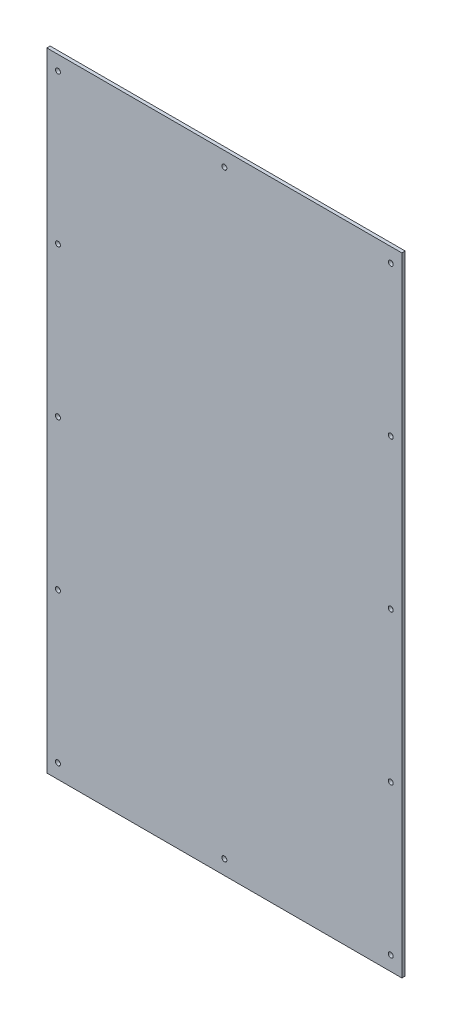
ISO-10303-21;
HEADER;
FILE_DESCRIPTION(('STEP AP214'),'2;1');
FILE_NAME('part.step','',(''),(''),'','','');
FILE_SCHEMA(('AUTOMOTIVE_DESIGN { 1 0 10303 214 1 1 1 1 }'));
ENDSEC;
DATA;
#1=APPLICATION_CONTEXT('core data for automotive mechanical design processes');
#2=APPLICATION_PROTOCOL_DEFINITION('international standard','automotive_design',2000,#1);
#3=PRODUCT_CONTEXT('',#1,'mechanical');
#4=PRODUCT('Part','Part','',(#3));
#5=PRODUCT_RELATED_PRODUCT_CATEGORY('part','',(#4));
#6=PRODUCT_DEFINITION_FORMATION('','',#4);
#7=PRODUCT_DEFINITION_CONTEXT('part definition',#1,'design');
#8=PRODUCT_DEFINITION('design','',#6,#7);
#9=PRODUCT_DEFINITION_SHAPE('','',#8);
#10=(LENGTH_UNIT() NAMED_UNIT(*) SI_UNIT(.MILLI.,.METRE.));
#11=(NAMED_UNIT(*) PLANE_ANGLE_UNIT() SI_UNIT($,.RADIAN.));
#12=(NAMED_UNIT(*) SI_UNIT($,.STERADIAN.) SOLID_ANGLE_UNIT());
#13=UNCERTAINTY_MEASURE_WITH_UNIT(LENGTH_MEASURE(1.E-05),#10,'distance_accuracy_value','');
#14=(GEOMETRIC_REPRESENTATION_CONTEXT(3) GLOBAL_UNCERTAINTY_ASSIGNED_CONTEXT((#13)) GLOBAL_UNIT_ASSIGNED_CONTEXT((#10,
#11,#12)) REPRESENTATION_CONTEXT('',''));
#15=CARTESIAN_POINT('',(0.,0.,0.));
#16=DIRECTION('',(0.,0.,1.));
#17=DIRECTION('',(1.,0.,0.));
#18=AXIS2_PLACEMENT_3D('',#15,#16,#17);
#19=CARTESIAN_POINT('',(0.,0.,3.));
#20=DIRECTION('',(0.,0.,-1.));
#21=DIRECTION('',(-1.,0.,0.));
#22=AXIS2_PLACEMENT_3D('',#19,#20,#21);
#23=PLANE('',#22);
#24=DIRECTION('',(0.,-1.,0.));
#25=VECTOR('',#24,1.);
#26=CARTESIAN_POINT('',(0.,0.,3.));
#27=LINE('',#26,#25);
#28=CARTESIAN_POINT('',(0.,566.,3.));
#29=VERTEX_POINT('',#28);
#30=CARTESIAN_POINT('',(0.,0.,3.));
#31=VERTEX_POINT('',#30);
#32=EDGE_CURVE('E89',#29,#31,#27,.T.);
#33=ORIENTED_EDGE('',*,*,#32,.T.);
#34=DIRECTION('',(1.,0.,0.));
#35=VECTOR('',#34,1.);
#36=CARTESIAN_POINT('',(0.,0.,3.));
#37=LINE('',#36,#35);
#38=CARTESIAN_POINT('',(320.,0.,3.));
#39=VERTEX_POINT('',#38);
#40=EDGE_CURVE('E84',#31,#39,#37,.T.);
#41=ORIENTED_EDGE('',*,*,#40,.T.);
#42=DIRECTION('',(0.,1.,0.));
#43=VECTOR('',#42,1.);
#44=CARTESIAN_POINT('',(320.,0.,3.));
#45=LINE('',#44,#43);
#46=CARTESIAN_POINT('',(320.,566.,3.));
#47=VERTEX_POINT('',#46);
#48=EDGE_CURVE('E87',#39,#47,#45,.T.);
#49=ORIENTED_EDGE('',*,*,#48,.T.);
#50=DIRECTION('',(-1.,0.,0.));
#51=VECTOR('',#50,1.);
#52=CARTESIAN_POINT('',(0.,566.,3.));
#53=LINE('',#52,#51);
#54=EDGE_CURVE('E54',#47,#29,#53,.T.);
#55=ORIENTED_EDGE('',*,*,#54,.T.);
#56=EDGE_LOOP('',(#33,#41,#49,#55));
#57=FACE_BOUND('',#56,.T.);
#58=CARTESIAN_POINT('',(9.9999999999998,553.,3.));
#59=DIRECTION('',(0.,0.,1.));
#60=DIRECTION('',(1.,0.,0.));
#61=AXIS2_PLACEMENT_3D('',#58,#59,#60);
#62=CIRCLE('',#61,2.24999999999997);
#63=CARTESIAN_POINT('',(12.2499999999998,553.,3.));
#64=VERTEX_POINT('',#63);
#65=EDGE_CURVE('E104',#64,#64,#62,.T.);
#66=ORIENTED_EDGE('',*,*,#65,.F.);
#67=EDGE_LOOP('',(#66));
#68=FACE_BOUND('',#67,.T.);
#69=CARTESIAN_POINT('',(9.9999999999998,418.,3.));
#70=DIRECTION('',(0.,0.,1.));
#71=DIRECTION('',(1.,0.,0.));
#72=AXIS2_PLACEMENT_3D('',#69,#70,#71);
#73=CIRCLE('',#72,2.24999999999999);
#74=CARTESIAN_POINT('',(12.2499999999998,418.,3.));
#75=VERTEX_POINT('',#74);
#76=EDGE_CURVE('E119',#75,#75,#73,.T.);
#77=ORIENTED_EDGE('',*,*,#76,.F.);
#78=EDGE_LOOP('',(#77));
#79=FACE_BOUND('',#78,.T.);
#80=CARTESIAN_POINT('',(9.99999999999978,283.,3.));
#81=DIRECTION('',(0.,0.,1.));
#82=DIRECTION('',(1.,0.,0.));
#83=AXIS2_PLACEMENT_3D('',#80,#81,#82);
#84=CIRCLE('',#83,2.24999999999999);
#85=CARTESIAN_POINT('',(12.2499999999998,283.,3.));
#86=VERTEX_POINT('',#85);
#87=EDGE_CURVE('E125',#86,#86,#84,.T.);
#88=ORIENTED_EDGE('',*,*,#87,.F.);
#89=EDGE_LOOP('',(#88));
#90=FACE_BOUND('',#89,.T.);
#91=CARTESIAN_POINT('',(9.99999999999976,148.,3.));
#92=DIRECTION('',(0.,0.,1.));
#93=DIRECTION('',(1.,0.,0.));
#94=AXIS2_PLACEMENT_3D('',#91,#92,#93);
#95=CIRCLE('',#94,2.24999999999999);
#96=CARTESIAN_POINT('',(12.2499999999997,148.,3.));
#97=VERTEX_POINT('',#96);
#98=EDGE_CURVE('E131',#97,#97,#95,.T.);
#99=ORIENTED_EDGE('',*,*,#98,.F.);
#100=EDGE_LOOP('',(#99));
#101=FACE_BOUND('',#100,.T.);
#102=CARTESIAN_POINT('',(9.99999999999974,12.9999999999999,3.));
#103=DIRECTION('',(0.,0.,1.));
#104=DIRECTION('',(1.,0.,0.));
#105=AXIS2_PLACEMENT_3D('',#102,#103,#104);
#106=CIRCLE('',#105,2.24999999999999);
#107=CARTESIAN_POINT('',(12.2499999999997,12.9999999999999,3.));
#108=VERTEX_POINT('',#107);
#109=EDGE_CURVE('E137',#108,#108,#106,.T.);
#110=ORIENTED_EDGE('',*,*,#109,.F.);
#111=EDGE_LOOP('',(#110));
#112=FACE_BOUND('',#111,.T.);
#113=CARTESIAN_POINT('',(160.,553.,3.));
#114=DIRECTION('',(0.,0.,1.));
#115=DIRECTION('',(1.,0.,0.));
#116=AXIS2_PLACEMENT_3D('',#113,#114,#115);
#117=CIRCLE('',#116,2.24999999999999);
#118=CARTESIAN_POINT('',(162.25,553.,3.));
#119=VERTEX_POINT('',#118);
#120=EDGE_CURVE('E143',#119,#119,#117,.T.);
#121=ORIENTED_EDGE('',*,*,#120,.F.);
#122=EDGE_LOOP('',(#121));
#123=FACE_BOUND('',#122,.T.);
#124=CARTESIAN_POINT('',(160.,13.,3.));
#125=DIRECTION('',(0.,0.,1.));
#126=DIRECTION('',(1.,0.,0.));
#127=AXIS2_PLACEMENT_3D('',#124,#125,#126);
#128=CIRCLE('',#127,2.25000000000001);
#129=CARTESIAN_POINT('',(162.25,13.,3.));
#130=VERTEX_POINT('',#129);
#131=EDGE_CURVE('E149',#130,#130,#128,.T.);
#132=ORIENTED_EDGE('',*,*,#131,.F.);
#133=EDGE_LOOP('',(#132));
#134=FACE_BOUND('',#133,.T.);
#135=CARTESIAN_POINT('',(310.,553.,3.));
#136=DIRECTION('',(0.,0.,1.));
#137=DIRECTION('',(1.,0.,0.));
#138=AXIS2_PLACEMENT_3D('',#135,#136,#137);
#139=CIRCLE('',#138,2.24999999999983);
#140=CARTESIAN_POINT('',(312.25,553.,3.));
#141=VERTEX_POINT('',#140);
#142=EDGE_CURVE('E155',#141,#141,#139,.T.);
#143=ORIENTED_EDGE('',*,*,#142,.F.);
#144=EDGE_LOOP('',(#143));
#145=FACE_BOUND('',#144,.T.);
#146=CARTESIAN_POINT('',(310.,418.,3.));
#147=DIRECTION('',(0.,0.,1.));
#148=DIRECTION('',(1.,0.,0.));
#149=AXIS2_PLACEMENT_3D('',#146,#147,#148);
#150=CIRCLE('',#149,2.2499999999999);
#151=CARTESIAN_POINT('',(312.25,418.,3.));
#152=VERTEX_POINT('',#151);
#153=EDGE_CURVE('E161',#152,#152,#150,.T.);
#154=ORIENTED_EDGE('',*,*,#153,.F.);
#155=EDGE_LOOP('',(#154));
#156=FACE_BOUND('',#155,.T.);
#157=CARTESIAN_POINT('',(310.,283.,3.));
#158=DIRECTION('',(0.,0.,1.));
#159=DIRECTION('',(1.,0.,0.));
#160=AXIS2_PLACEMENT_3D('',#157,#158,#159);
#161=CIRCLE('',#160,2.2499999999999);
#162=CARTESIAN_POINT('',(312.25,283.,3.));
#163=VERTEX_POINT('',#162);
#164=EDGE_CURVE('E167',#163,#163,#161,.T.);
#165=ORIENTED_EDGE('',*,*,#164,.F.);
#166=EDGE_LOOP('',(#165));
#167=FACE_BOUND('',#166,.T.);
#168=CARTESIAN_POINT('',(310.,148.,3.));
#169=DIRECTION('',(0.,0.,1.));
#170=DIRECTION('',(1.,0.,0.));
#171=AXIS2_PLACEMENT_3D('',#168,#169,#170);
#172=CIRCLE('',#171,2.2499999999999);
#173=CARTESIAN_POINT('',(312.25,148.,3.));
#174=VERTEX_POINT('',#173);
#175=EDGE_CURVE('E173',#174,#174,#172,.T.);
#176=ORIENTED_EDGE('',*,*,#175,.F.);
#177=EDGE_LOOP('',(#176));
#178=FACE_BOUND('',#177,.T.);
#179=CARTESIAN_POINT('',(310.,12.9999999999999,3.));
#180=DIRECTION('',(0.,0.,1.));
#181=DIRECTION('',(1.,0.,0.));
#182=AXIS2_PLACEMENT_3D('',#179,#180,#181);
#183=CIRCLE('',#182,2.2499999999999);
#184=CARTESIAN_POINT('',(312.25,12.9999999999999,3.));
#185=VERTEX_POINT('',#184);
#186=EDGE_CURVE('E179',#185,#185,#183,.T.);
#187=ORIENTED_EDGE('',*,*,#186,.F.);
#188=EDGE_LOOP('',(#187));
#189=FACE_BOUND('',#188,.T.);
#190=ADVANCED_FACE('F37',(#57,#68,#79,#90,#101,#112,#123,#134,#145,#156,#167,#178,#189),#23,.F.);
#191=CARTESIAN_POINT('',(0.,0.,0.));
#192=DIRECTION('',(0.,0.,-1.));
#193=DIRECTION('',(-1.,0.,0.));
#194=AXIS2_PLACEMENT_3D('',#191,#192,#193);
#195=PLANE('',#194);
#196=CARTESIAN_POINT('',(310.,148.,0.));
#197=DIRECTION('',(0.,0.,1.));
#198=DIRECTION('',(1.,0.,0.));
#199=AXIS2_PLACEMENT_3D('',#196,#197,#198);
#200=CIRCLE('',#199,2.2499999999999);
#201=CARTESIAN_POINT('',(312.25,148.,0.));
#202=VERTEX_POINT('',#201);
#203=EDGE_CURVE('E176',#202,#202,#200,.T.);
#204=ORIENTED_EDGE('',*,*,#203,.T.);
#205=EDGE_LOOP('',(#204));
#206=FACE_BOUND('',#205,.T.);
#207=CARTESIAN_POINT('',(310.,418.,0.));
#208=DIRECTION('',(0.,0.,1.));
#209=DIRECTION('',(1.,0.,0.));
#210=AXIS2_PLACEMENT_3D('',#207,#208,#209);
#211=CIRCLE('',#210,2.2499999999999);
#212=CARTESIAN_POINT('',(312.25,418.,0.));
#213=VERTEX_POINT('',#212);
#214=EDGE_CURVE('E164',#213,#213,#211,.T.);
#215=ORIENTED_EDGE('',*,*,#214,.T.);
#216=EDGE_LOOP('',(#215));
#217=FACE_BOUND('',#216,.T.);
#218=CARTESIAN_POINT('',(160.,13.,0.));
#219=DIRECTION('',(0.,0.,1.));
#220=DIRECTION('',(1.,0.,0.));
#221=AXIS2_PLACEMENT_3D('',#218,#219,#220);
#222=CIRCLE('',#221,2.25000000000001);
#223=CARTESIAN_POINT('',(162.25,13.,0.));
#224=VERTEX_POINT('',#223);
#225=EDGE_CURVE('E152',#224,#224,#222,.T.);
#226=ORIENTED_EDGE('',*,*,#225,.T.);
#227=EDGE_LOOP('',(#226));
#228=FACE_BOUND('',#227,.T.);
#229=CARTESIAN_POINT('',(9.99999999999974,12.9999999999999,0.));
#230=DIRECTION('',(0.,0.,1.));
#231=DIRECTION('',(1.,0.,0.));
#232=AXIS2_PLACEMENT_3D('',#229,#230,#231);
#233=CIRCLE('',#232,2.24999999999999);
#234=CARTESIAN_POINT('',(12.2499999999997,12.9999999999999,0.));
#235=VERTEX_POINT('',#234);
#236=EDGE_CURVE('E140',#235,#235,#233,.T.);
#237=ORIENTED_EDGE('',*,*,#236,.T.);
#238=EDGE_LOOP('',(#237));
#239=FACE_BOUND('',#238,.T.);
#240=CARTESIAN_POINT('',(9.99999999999978,283.,0.));
#241=DIRECTION('',(0.,0.,1.));
#242=DIRECTION('',(1.,0.,0.));
#243=AXIS2_PLACEMENT_3D('',#240,#241,#242);
#244=CIRCLE('',#243,2.24999999999999);
#245=CARTESIAN_POINT('',(12.2499999999998,283.,0.));
#246=VERTEX_POINT('',#245);
#247=EDGE_CURVE('E128',#246,#246,#244,.T.);
#248=ORIENTED_EDGE('',*,*,#247,.T.);
#249=EDGE_LOOP('',(#248));
#250=FACE_BOUND('',#249,.T.);
#251=CARTESIAN_POINT('',(9.9999999999998,553.,0.));
#252=DIRECTION('',(0.,0.,1.));
#253=DIRECTION('',(1.,0.,0.));
#254=AXIS2_PLACEMENT_3D('',#251,#252,#253);
#255=CIRCLE('',#254,2.24999999999997);
#256=CARTESIAN_POINT('',(12.2499999999998,553.,0.));
#257=VERTEX_POINT('',#256);
#258=EDGE_CURVE('E116',#257,#257,#255,.T.);
#259=ORIENTED_EDGE('',*,*,#258,.T.);
#260=EDGE_LOOP('',(#259));
#261=FACE_BOUND('',#260,.T.);
#262=DIRECTION('',(0.,-1.,0.));
#263=VECTOR('',#262,1.);
#264=CARTESIAN_POINT('',(0.,0.,0.));
#265=LINE('',#264,#263);
#266=CARTESIAN_POINT('',(0.,566.,0.));
#267=VERTEX_POINT('',#266);
#268=CARTESIAN_POINT('',(0.,0.,0.));
#269=VERTEX_POINT('',#268);
#270=EDGE_CURVE('E101',#267,#269,#265,.T.);
#271=ORIENTED_EDGE('',*,*,#270,.F.);
#272=DIRECTION('',(-1.,0.,0.));
#273=VECTOR('',#272,1.);
#274=CARTESIAN_POINT('',(0.,566.,0.));
#275=LINE('',#274,#273);
#276=CARTESIAN_POINT('',(320.,566.,0.));
#277=VERTEX_POINT('',#276);
#278=EDGE_CURVE('E77',#277,#267,#275,.T.);
#279=ORIENTED_EDGE('',*,*,#278,.F.);
#280=DIRECTION('',(0.,1.,0.));
#281=VECTOR('',#280,1.);
#282=CARTESIAN_POINT('',(320.,0.,0.));
#283=LINE('',#282,#281);
#284=CARTESIAN_POINT('',(320.,0.,0.));
#285=VERTEX_POINT('',#284);
#286=EDGE_CURVE('E71',#285,#277,#283,.T.);
#287=ORIENTED_EDGE('',*,*,#286,.F.);
#288=DIRECTION('',(1.,0.,0.));
#289=VECTOR('',#288,1.);
#290=CARTESIAN_POINT('',(0.,0.,0.));
#291=LINE('',#290,#289);
#292=EDGE_CURVE('E93',#269,#285,#291,.T.);
#293=ORIENTED_EDGE('',*,*,#292,.F.);
#294=EDGE_LOOP('',(#271,#279,#287,#293));
#295=FACE_BOUND('',#294,.T.);
#296=CARTESIAN_POINT('',(9.9999999999998,418.,0.));
#297=DIRECTION('',(0.,0.,1.));
#298=DIRECTION('',(1.,0.,0.));
#299=AXIS2_PLACEMENT_3D('',#296,#297,#298);
#300=CIRCLE('',#299,2.24999999999999);
#301=CARTESIAN_POINT('',(12.2499999999998,418.,0.));
#302=VERTEX_POINT('',#301);
#303=EDGE_CURVE('E122',#302,#302,#300,.T.);
#304=ORIENTED_EDGE('',*,*,#303,.T.);
#305=EDGE_LOOP('',(#304));
#306=FACE_BOUND('',#305,.T.);
#307=CARTESIAN_POINT('',(9.99999999999976,148.,0.));
#308=DIRECTION('',(0.,0.,1.));
#309=DIRECTION('',(1.,0.,0.));
#310=AXIS2_PLACEMENT_3D('',#307,#308,#309);
#311=CIRCLE('',#310,2.24999999999999);
#312=CARTESIAN_POINT('',(12.2499999999997,148.,0.));
#313=VERTEX_POINT('',#312);
#314=EDGE_CURVE('E134',#313,#313,#311,.T.);
#315=ORIENTED_EDGE('',*,*,#314,.T.);
#316=EDGE_LOOP('',(#315));
#317=FACE_BOUND('',#316,.T.);
#318=CARTESIAN_POINT('',(160.,553.,0.));
#319=DIRECTION('',(0.,0.,1.));
#320=DIRECTION('',(1.,0.,0.));
#321=AXIS2_PLACEMENT_3D('',#318,#319,#320);
#322=CIRCLE('',#321,2.24999999999999);
#323=CARTESIAN_POINT('',(162.25,553.,0.));
#324=VERTEX_POINT('',#323);
#325=EDGE_CURVE('E146',#324,#324,#322,.T.);
#326=ORIENTED_EDGE('',*,*,#325,.T.);
#327=EDGE_LOOP('',(#326));
#328=FACE_BOUND('',#327,.T.);
#329=CARTESIAN_POINT('',(310.,553.,0.));
#330=DIRECTION('',(0.,0.,1.));
#331=DIRECTION('',(1.,0.,0.));
#332=AXIS2_PLACEMENT_3D('',#329,#330,#331);
#333=CIRCLE('',#332,2.24999999999983);
#334=CARTESIAN_POINT('',(312.25,553.,0.));
#335=VERTEX_POINT('',#334);
#336=EDGE_CURVE('E158',#335,#335,#333,.T.);
#337=ORIENTED_EDGE('',*,*,#336,.T.);
#338=EDGE_LOOP('',(#337));
#339=FACE_BOUND('',#338,.T.);
#340=CARTESIAN_POINT('',(310.,283.,0.));
#341=DIRECTION('',(0.,0.,1.));
#342=DIRECTION('',(1.,0.,0.));
#343=AXIS2_PLACEMENT_3D('',#340,#341,#342);
#344=CIRCLE('',#343,2.2499999999999);
#345=CARTESIAN_POINT('',(312.25,283.,0.));
#346=VERTEX_POINT('',#345);
#347=EDGE_CURVE('E170',#346,#346,#344,.T.);
#348=ORIENTED_EDGE('',*,*,#347,.T.);
#349=EDGE_LOOP('',(#348));
#350=FACE_BOUND('',#349,.T.);
#351=CARTESIAN_POINT('',(310.,12.9999999999999,0.));
#352=DIRECTION('',(0.,0.,1.));
#353=DIRECTION('',(1.,0.,0.));
#354=AXIS2_PLACEMENT_3D('',#351,#352,#353);
#355=CIRCLE('',#354,2.2499999999999);
#356=CARTESIAN_POINT('',(312.25,12.9999999999999,0.));
#357=VERTEX_POINT('',#356);
#358=EDGE_CURVE('E182',#357,#357,#355,.T.);
#359=ORIENTED_EDGE('',*,*,#358,.T.);
#360=EDGE_LOOP('',(#359));
#361=FACE_BOUND('',#360,.T.);
#362=ADVANCED_FACE('F112',(#206,#217,#228,#239,#250,#261,#295,#306,#317,#328,#339,#350,#361),
#195,.T.);
#363=CARTESIAN_POINT('',(0.,0.,3.));
#364=DIRECTION('',(1.,0.,0.));
#365=DIRECTION('',(0.,0.,-1.));
#366=AXIS2_PLACEMENT_3D('',#363,#364,#365);
#367=PLANE('',#366);
#368=ORIENTED_EDGE('',*,*,#270,.T.);
#369=DIRECTION('',(0.,0.,-1.));
#370=VECTOR('',#369,1.);
#371=CARTESIAN_POINT('',(0.,0.,3.));
#372=LINE('',#371,#370);
#373=EDGE_CURVE('E11',#31,#269,#372,.T.);
#374=ORIENTED_EDGE('',*,*,#373,.F.);
#375=ORIENTED_EDGE('',*,*,#32,.F.);
#376=DIRECTION('',(0.,0.,-1.));
#377=VECTOR('',#376,1.);
#378=CARTESIAN_POINT('',(0.,566.,3.));
#379=LINE('',#378,#377);
#380=EDGE_CURVE('E97',#29,#267,#379,.T.);
#381=ORIENTED_EDGE('',*,*,#380,.T.);
#382=EDGE_LOOP('',(#368,#374,#375,#381));
#383=FACE_BOUND('',#382,.T.);
#384=ADVANCED_FACE('F39',(#383),#367,.F.);
#385=CARTESIAN_POINT('',(0.,0.,3.));
#386=DIRECTION('',(0.,1.,0.));
#387=DIRECTION('',(0.,0.,1.));
#388=AXIS2_PLACEMENT_3D('',#385,#386,#387);
#389=PLANE('',#388);
#390=ORIENTED_EDGE('',*,*,#292,.T.);
#391=DIRECTION('',(0.,0.,-1.));
#392=VECTOR('',#391,1.);
#393=CARTESIAN_POINT('',(320.,0.,3.));
#394=LINE('',#393,#392);
#395=EDGE_CURVE('E46',#39,#285,#394,.T.);
#396=ORIENTED_EDGE('',*,*,#395,.F.);
#397=ORIENTED_EDGE('',*,*,#40,.F.);
#398=ORIENTED_EDGE('',*,*,#373,.T.);
#399=EDGE_LOOP('',(#390,#396,#397,#398));
#400=FACE_BOUND('',#399,.T.);
#401=ADVANCED_FACE('F92',(#400),#389,.F.);
#402=CARTESIAN_POINT('',(320.,0.,3.));
#403=DIRECTION('',(-1.,0.,0.));
#404=DIRECTION('',(0.,-1.,0.));
#405=AXIS2_PLACEMENT_3D('',#402,#403,#404);
#406=PLANE('',#405);
#407=ORIENTED_EDGE('',*,*,#286,.T.);
#408=DIRECTION('',(0.,0.,-1.));
#409=VECTOR('',#408,1.);
#410=CARTESIAN_POINT('',(320.,566.,3.));
#411=LINE('',#410,#409);
#412=EDGE_CURVE('E94',#47,#277,#411,.T.);
#413=ORIENTED_EDGE('',*,*,#412,.F.);
#414=ORIENTED_EDGE('',*,*,#48,.F.);
#415=ORIENTED_EDGE('',*,*,#395,.T.);
#416=EDGE_LOOP('',(#407,#413,#414,#415));
#417=FACE_BOUND('',#416,.T.);
#418=ADVANCED_FACE('F95',(#417),#406,.F.);
#419=CARTESIAN_POINT('',(0.,566.,3.));
#420=DIRECTION('',(0.,-1.,0.));
#421=DIRECTION('',(0.,0.,-1.));
#422=AXIS2_PLACEMENT_3D('',#419,#420,#421);
#423=PLANE('',#422);
#424=ORIENTED_EDGE('',*,*,#278,.T.);
#425=ORIENTED_EDGE('',*,*,#380,.F.);
#426=ORIENTED_EDGE('',*,*,#54,.F.);
#427=ORIENTED_EDGE('',*,*,#412,.T.);
#428=EDGE_LOOP('',(#424,#425,#426,#427));
#429=FACE_BOUND('',#428,.T.);
#430=ADVANCED_FACE('F109',(#429),#423,.F.);
#431=CARTESIAN_POINT('',(9.9999999999998,553.,3.));
#432=DIRECTION('',(0.,0.,-1.));
#433=DIRECTION('',(-1.,0.,0.));
#434=AXIS2_PLACEMENT_3D('',#431,#432,#433);
#435=CYLINDRICAL_SURFACE('',#434,2.24999999999997);
#436=ORIENTED_EDGE('',*,*,#65,.T.);
#437=EDGE_LOOP('',(#436));
#438=FACE_BOUND('',#437,.T.);
#439=ORIENTED_EDGE('',*,*,#258,.F.);
#440=EDGE_LOOP('',(#439));
#441=FACE_BOUND('',#440,.T.);
#442=ADVANCED_FACE('F199',(#438,#441),#435,.F.);
#443=CARTESIAN_POINT('',(9.9999999999998,418.,3.));
#444=DIRECTION('',(0.,0.,-1.));
#445=DIRECTION('',(-1.,0.,0.));
#446=AXIS2_PLACEMENT_3D('',#443,#444,#445);
#447=CYLINDRICAL_SURFACE('',#446,2.24999999999999);
#448=ORIENTED_EDGE('',*,*,#76,.T.);
#449=EDGE_LOOP('',(#448));
#450=FACE_BOUND('',#449,.T.);
#451=ORIENTED_EDGE('',*,*,#303,.F.);
#452=EDGE_LOOP('',(#451));
#453=FACE_BOUND('',#452,.T.);
#454=ADVANCED_FACE('F245',(#450,#453),#447,.F.);
#455=CARTESIAN_POINT('',(9.99999999999978,283.,3.));
#456=DIRECTION('',(0.,0.,-1.));
#457=DIRECTION('',(-1.,0.,0.));
#458=AXIS2_PLACEMENT_3D('',#455,#456,#457);
#459=CYLINDRICAL_SURFACE('',#458,2.24999999999999);
#460=ORIENTED_EDGE('',*,*,#87,.T.);
#461=EDGE_LOOP('',(#460));
#462=FACE_BOUND('',#461,.T.);
#463=ORIENTED_EDGE('',*,*,#247,.F.);
#464=EDGE_LOOP('',(#463));
#465=FACE_BOUND('',#464,.T.);
#466=ADVANCED_FACE('F253',(#462,#465),#459,.F.);
#467=CARTESIAN_POINT('',(9.99999999999976,148.,3.));
#468=DIRECTION('',(0.,0.,-1.));
#469=DIRECTION('',(-1.,0.,0.));
#470=AXIS2_PLACEMENT_3D('',#467,#468,#469);
#471=CYLINDRICAL_SURFACE('',#470,2.24999999999999);
#472=ORIENTED_EDGE('',*,*,#98,.T.);
#473=EDGE_LOOP('',(#472));
#474=FACE_BOUND('',#473,.T.);
#475=ORIENTED_EDGE('',*,*,#314,.F.);
#476=EDGE_LOOP('',(#475));
#477=FACE_BOUND('',#476,.T.);
#478=ADVANCED_FACE('F261',(#474,#477),#471,.F.);
#479=CARTESIAN_POINT('',(9.99999999999974,12.9999999999999,3.));
#480=DIRECTION('',(0.,0.,-1.));
#481=DIRECTION('',(-1.,0.,0.));
#482=AXIS2_PLACEMENT_3D('',#479,#480,#481);
#483=CYLINDRICAL_SURFACE('',#482,2.24999999999999);
#484=ORIENTED_EDGE('',*,*,#109,.T.);
#485=EDGE_LOOP('',(#484));
#486=FACE_BOUND('',#485,.T.);
#487=ORIENTED_EDGE('',*,*,#236,.F.);
#488=EDGE_LOOP('',(#487));
#489=FACE_BOUND('',#488,.T.);
#490=ADVANCED_FACE('F270',(#486,#489),#483,.F.);
#491=CARTESIAN_POINT('',(160.,553.,3.));
#492=DIRECTION('',(0.,0.,-1.));
#493=DIRECTION('',(-1.,0.,0.));
#494=AXIS2_PLACEMENT_3D('',#491,#492,#493);
#495=CYLINDRICAL_SURFACE('',#494,2.24999999999999);
#496=ORIENTED_EDGE('',*,*,#120,.T.);
#497=EDGE_LOOP('',(#496));
#498=FACE_BOUND('',#497,.T.);
#499=ORIENTED_EDGE('',*,*,#325,.F.);
#500=EDGE_LOOP('',(#499));
#501=FACE_BOUND('',#500,.T.);
#502=ADVANCED_FACE('F279',(#498,#501),#495,.F.);
#503=CARTESIAN_POINT('',(160.,13.,3.));
#504=DIRECTION('',(0.,0.,-1.));
#505=DIRECTION('',(-1.,0.,0.));
#506=AXIS2_PLACEMENT_3D('',#503,#504,#505);
#507=CYLINDRICAL_SURFACE('',#506,2.25000000000001);
#508=ORIENTED_EDGE('',*,*,#131,.T.);
#509=EDGE_LOOP('',(#508));
#510=FACE_BOUND('',#509,.T.);
#511=ORIENTED_EDGE('',*,*,#225,.F.);
#512=EDGE_LOOP('',(#511));
#513=FACE_BOUND('',#512,.T.);
#514=ADVANCED_FACE('F288',(#510,#513),#507,.F.);
#515=CARTESIAN_POINT('',(310.,553.,3.));
#516=DIRECTION('',(0.,0.,-1.));
#517=DIRECTION('',(-1.,0.,0.));
#518=AXIS2_PLACEMENT_3D('',#515,#516,#517);
#519=CYLINDRICAL_SURFACE('',#518,2.24999999999983);
#520=ORIENTED_EDGE('',*,*,#142,.T.);
#521=EDGE_LOOP('',(#520));
#522=FACE_BOUND('',#521,.T.);
#523=ORIENTED_EDGE('',*,*,#336,.F.);
#524=EDGE_LOOP('',(#523));
#525=FACE_BOUND('',#524,.T.);
#526=ADVANCED_FACE('F297',(#522,#525),#519,.F.);
#527=CARTESIAN_POINT('',(310.,418.,3.));
#528=DIRECTION('',(0.,0.,-1.));
#529=DIRECTION('',(-1.,0.,0.));
#530=AXIS2_PLACEMENT_3D('',#527,#528,#529);
#531=CYLINDRICAL_SURFACE('',#530,2.2499999999999);
#532=ORIENTED_EDGE('',*,*,#153,.T.);
#533=EDGE_LOOP('',(#532));
#534=FACE_BOUND('',#533,.T.);
#535=ORIENTED_EDGE('',*,*,#214,.F.);
#536=EDGE_LOOP('',(#535));
#537=FACE_BOUND('',#536,.T.);
#538=ADVANCED_FACE('F306',(#534,#537),#531,.F.);
#539=CARTESIAN_POINT('',(310.,283.,3.));
#540=DIRECTION('',(0.,0.,-1.));
#541=DIRECTION('',(-1.,0.,0.));
#542=AXIS2_PLACEMENT_3D('',#539,#540,#541);
#543=CYLINDRICAL_SURFACE('',#542,2.2499999999999);
#544=ORIENTED_EDGE('',*,*,#164,.T.);
#545=EDGE_LOOP('',(#544));
#546=FACE_BOUND('',#545,.T.);
#547=ORIENTED_EDGE('',*,*,#347,.F.);
#548=EDGE_LOOP('',(#547));
#549=FACE_BOUND('',#548,.T.);
#550=ADVANCED_FACE('F315',(#546,#549),#543,.F.);
#551=CARTESIAN_POINT('',(310.,148.,3.));
#552=DIRECTION('',(0.,0.,-1.));
#553=DIRECTION('',(-1.,0.,0.));
#554=AXIS2_PLACEMENT_3D('',#551,#552,#553);
#555=CYLINDRICAL_SURFACE('',#554,2.2499999999999);
#556=ORIENTED_EDGE('',*,*,#175,.T.);
#557=EDGE_LOOP('',(#556));
#558=FACE_BOUND('',#557,.T.);
#559=ORIENTED_EDGE('',*,*,#203,.F.);
#560=EDGE_LOOP('',(#559));
#561=FACE_BOUND('',#560,.T.);
#562=ADVANCED_FACE('F324',(#558,#561),#555,.F.);
#563=CARTESIAN_POINT('',(310.,12.9999999999999,3.));
#564=DIRECTION('',(0.,0.,-1.));
#565=DIRECTION('',(-1.,0.,0.));
#566=AXIS2_PLACEMENT_3D('',#563,#564,#565);
#567=CYLINDRICAL_SURFACE('',#566,2.2499999999999);
#568=ORIENTED_EDGE('',*,*,#186,.T.);
#569=EDGE_LOOP('',(#568));
#570=FACE_BOUND('',#569,.T.);
#571=ORIENTED_EDGE('',*,*,#358,.F.);
#572=EDGE_LOOP('',(#571));
#573=FACE_BOUND('',#572,.T.);
#574=ADVANCED_FACE('F188',(#570,#573),#567,.F.);
#575=CLOSED_SHELL('',(#190,#362,#384,#401,#418,#430,#442,#454,#466,#478,#490,#502,#514,#526,
#538,#550,#562,#574));
#576=MANIFOLD_SOLID_BREP('B2',#575);
#577=ADVANCED_BREP_SHAPE_REPRESENTATION('',(#18,#576),#14);
#578=SHAPE_DEFINITION_REPRESENTATION(#9,#577);
ENDSEC;
END-ISO-10303-21;
